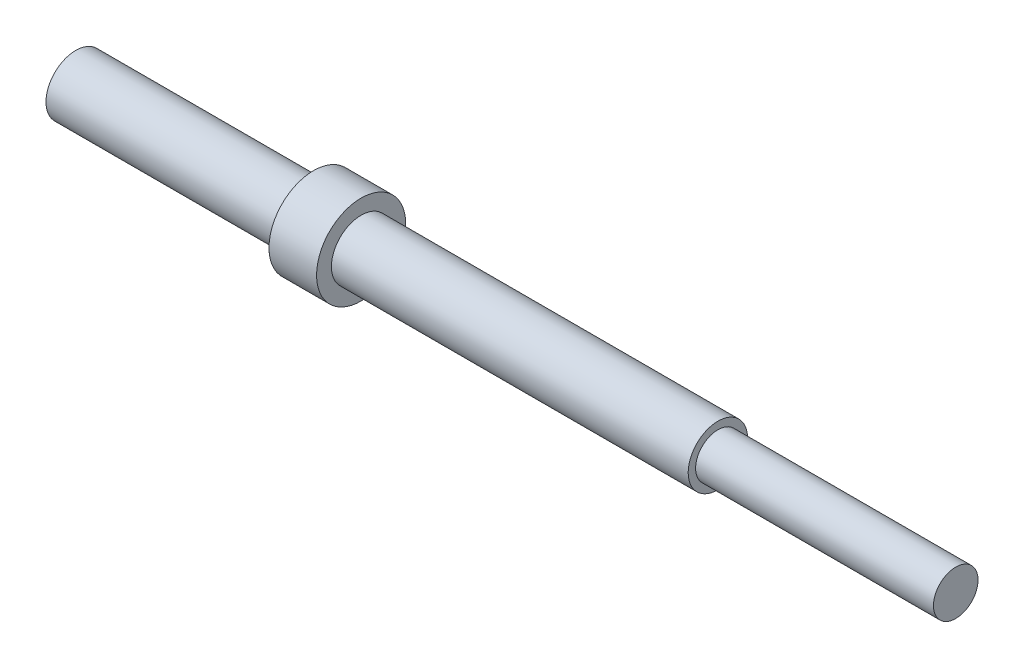
ISO-10303-21;
HEADER;
FILE_DESCRIPTION(('STEP AP214'),'2;1');
FILE_NAME('part.step','',(''),(''),'','','');
FILE_SCHEMA(('AUTOMOTIVE_DESIGN { 1 0 10303 214 1 1 1 1 }'));
ENDSEC;
DATA;
#1=APPLICATION_CONTEXT('core data for automotive mechanical design processes');
#2=APPLICATION_PROTOCOL_DEFINITION('international standard','automotive_design',2000,#1);
#3=PRODUCT_CONTEXT('',#1,'mechanical');
#4=PRODUCT('Part','Part','',(#3));
#5=PRODUCT_RELATED_PRODUCT_CATEGORY('part','',(#4));
#6=PRODUCT_DEFINITION_FORMATION('','',#4);
#7=PRODUCT_DEFINITION_CONTEXT('part definition',#1,'design');
#8=PRODUCT_DEFINITION('design','',#6,#7);
#9=PRODUCT_DEFINITION_SHAPE('','',#8);
#10=(LENGTH_UNIT() NAMED_UNIT(*) SI_UNIT(.MILLI.,.METRE.));
#11=(NAMED_UNIT(*) PLANE_ANGLE_UNIT() SI_UNIT($,.RADIAN.));
#12=(NAMED_UNIT(*) SI_UNIT($,.STERADIAN.) SOLID_ANGLE_UNIT());
#13=UNCERTAINTY_MEASURE_WITH_UNIT(LENGTH_MEASURE(1.E-05),#10,'distance_accuracy_value','');
#14=(GEOMETRIC_REPRESENTATION_CONTEXT(3) GLOBAL_UNCERTAINTY_ASSIGNED_CONTEXT((#13)) GLOBAL_UNIT_ASSIGNED_CONTEXT((#10,
#11,#12)) REPRESENTATION_CONTEXT('',''));
#15=CARTESIAN_POINT('',(0.,0.,0.));
#16=DIRECTION('',(0.,0.,1.));
#17=DIRECTION('',(1.,0.,0.));
#18=AXIS2_PLACEMENT_3D('',#15,#16,#17);
#19=CARTESIAN_POINT('',(93.98,2.38125,0.));
#20=DIRECTION('',(1.,0.,0.));
#21=DIRECTION('',(0.,0.,-1.));
#22=AXIS2_PLACEMENT_3D('',#19,#20,#21);
#23=PLANE('',#22);
#24=CARTESIAN_POINT('',(93.98,0.,0.));
#25=DIRECTION('',(-1.,0.,0.));
#26=DIRECTION('',(0.,0.,1.));
#27=AXIS2_PLACEMENT_3D('',#24,#25,#26);
#28=CIRCLE('',#27,2.38125);
#29=CARTESIAN_POINT('',(93.98,0.,2.38125));
#30=VERTEX_POINT('',#29);
#31=EDGE_CURVE('E10',#30,#30,#28,.T.);
#32=ORIENTED_EDGE('',*,*,#31,.F.);
#33=EDGE_LOOP('',(#32));
#34=FACE_BOUND('',#33,.T.);
#35=ADVANCED_FACE('F31',(#34),#23,.T.);
#36=CARTESIAN_POINT('',(0.,0.,0.));
#37=DIRECTION('',(-1.,0.,0.));
#38=DIRECTION('',(0.,0.,1.));
#39=AXIS2_PLACEMENT_3D('',#36,#37,#38);
#40=CYLINDRICAL_SURFACE('',#39,2.38125);
#41=ORIENTED_EDGE('',*,*,#31,.T.);
#42=EDGE_LOOP('',(#41));
#43=FACE_BOUND('',#42,.T.);
#44=CARTESIAN_POINT('',(68.58,0.,0.));
#45=DIRECTION('',(-1.,0.,0.));
#46=DIRECTION('',(0.,0.,1.));
#47=AXIS2_PLACEMENT_3D('',#44,#45,#46);
#48=CIRCLE('',#47,2.38125);
#49=CARTESIAN_POINT('',(68.58,0.,2.38125));
#50=VERTEX_POINT('',#49);
#51=EDGE_CURVE('E37',#50,#50,#48,.T.);
#52=ORIENTED_EDGE('',*,*,#51,.F.);
#53=EDGE_LOOP('',(#52));
#54=FACE_BOUND('',#53,.T.);
#55=ADVANCED_FACE('F89',(#43,#54),#40,.T.);
#56=CARTESIAN_POINT('',(68.58,3.175,0.));
#57=DIRECTION('',(1.,0.,0.));
#58=DIRECTION('',(0.,0.,-1.));
#59=AXIS2_PLACEMENT_3D('',#56,#57,#58);
#60=PLANE('',#59);
#61=ORIENTED_EDGE('',*,*,#51,.T.);
#62=EDGE_LOOP('',(#61));
#63=FACE_BOUND('',#62,.T.);
#64=CARTESIAN_POINT('',(68.58,0.,0.));
#65=DIRECTION('',(-1.,0.,0.));
#66=DIRECTION('',(0.,0.,1.));
#67=AXIS2_PLACEMENT_3D('',#64,#65,#66);
#68=CIRCLE('',#67,3.175);
#69=CARTESIAN_POINT('',(68.58,0.,3.175));
#70=VERTEX_POINT('',#69);
#71=EDGE_CURVE('E41',#70,#70,#68,.T.);
#72=ORIENTED_EDGE('',*,*,#71,.F.);
#73=EDGE_LOOP('',(#72));
#74=FACE_BOUND('',#73,.T.);
#75=ADVANCED_FACE('F94',(#63,#74),#60,.T.);
#76=CARTESIAN_POINT('',(0.,0.,0.));
#77=DIRECTION('',(-1.,0.,0.));
#78=DIRECTION('',(0.,0.,1.));
#79=AXIS2_PLACEMENT_3D('',#76,#77,#78);
#80=CYLINDRICAL_SURFACE('',#79,3.175);
#81=ORIENTED_EDGE('',*,*,#71,.T.);
#82=EDGE_LOOP('',(#81));
#83=FACE_BOUND('',#82,.T.);
#84=CARTESIAN_POINT('',(30.48,0.,0.));
#85=DIRECTION('',(-1.,0.,0.));
#86=DIRECTION('',(0.,0.,1.));
#87=AXIS2_PLACEMENT_3D('',#84,#85,#86);
#88=CIRCLE('',#87,3.175);
#89=CARTESIAN_POINT('',(30.48,0.,3.175));
#90=VERTEX_POINT('',#89);
#91=EDGE_CURVE('E45',#90,#90,#88,.T.);
#92=ORIENTED_EDGE('',*,*,#91,.F.);
#93=EDGE_LOOP('',(#92));
#94=FACE_BOUND('',#93,.T.);
#95=ADVANCED_FACE('F98',(#83,#94),#80,.T.);
#96=CARTESIAN_POINT('',(30.48,4.7625,0.));
#97=DIRECTION('',(1.,0.,0.));
#98=DIRECTION('',(0.,0.,-1.));
#99=AXIS2_PLACEMENT_3D('',#96,#97,#98);
#100=PLANE('',#99);
#101=ORIENTED_EDGE('',*,*,#91,.T.);
#102=EDGE_LOOP('',(#101));
#103=FACE_BOUND('',#102,.T.);
#104=CARTESIAN_POINT('',(30.48,0.,0.));
#105=DIRECTION('',(-1.,0.,0.));
#106=DIRECTION('',(0.,0.,1.));
#107=AXIS2_PLACEMENT_3D('',#104,#105,#106);
#108=CIRCLE('',#107,4.7625);
#109=CARTESIAN_POINT('',(30.48,0.,4.7625));
#110=VERTEX_POINT('',#109);
#111=EDGE_CURVE('E50',#110,#110,#108,.T.);
#112=ORIENTED_EDGE('',*,*,#111,.F.);
#113=EDGE_LOOP('',(#112));
#114=FACE_BOUND('',#113,.T.);
#115=ADVANCED_FACE('F104',(#103,#114),#100,.T.);
#116=CARTESIAN_POINT('',(0.,0.,0.));
#117=DIRECTION('',(-1.,0.,0.));
#118=DIRECTION('',(0.,0.,1.));
#119=AXIS2_PLACEMENT_3D('',#116,#117,#118);
#120=CYLINDRICAL_SURFACE('',#119,4.7625);
#121=ORIENTED_EDGE('',*,*,#111,.T.);
#122=EDGE_LOOP('',(#121));
#123=FACE_BOUND('',#122,.T.);
#124=CARTESIAN_POINT('',(25.4,0.,0.));
#125=DIRECTION('',(-1.,0.,0.));
#126=DIRECTION('',(0.,0.,1.));
#127=AXIS2_PLACEMENT_3D('',#124,#125,#126);
#128=CIRCLE('',#127,4.7625);
#129=CARTESIAN_POINT('',(25.4,0.,4.7625));
#130=VERTEX_POINT('',#129);
#131=EDGE_CURVE('E53',#130,#130,#128,.T.);
#132=ORIENTED_EDGE('',*,*,#131,.F.);
#133=EDGE_LOOP('',(#132));
#134=FACE_BOUND('',#133,.T.);
#135=ADVANCED_FACE('F108',(#123,#134),#120,.T.);
#136=CARTESIAN_POINT('',(25.4,3.175,0.));
#137=DIRECTION('',(-1.,0.,0.));
#138=DIRECTION('',(0.,0.,1.));
#139=AXIS2_PLACEMENT_3D('',#136,#137,#138);
#140=PLANE('',#139);
#141=ORIENTED_EDGE('',*,*,#131,.T.);
#142=EDGE_LOOP('',(#141));
#143=FACE_BOUND('',#142,.T.);
#144=CARTESIAN_POINT('',(25.4,0.,0.));
#145=DIRECTION('',(-1.,0.,0.));
#146=DIRECTION('',(0.,0.,1.));
#147=AXIS2_PLACEMENT_3D('',#144,#145,#146);
#148=CIRCLE('',#147,3.175);
#149=CARTESIAN_POINT('',(25.4,0.,3.175));
#150=VERTEX_POINT('',#149);
#151=EDGE_CURVE('E56',#150,#150,#148,.T.);
#152=ORIENTED_EDGE('',*,*,#151,.F.);
#153=EDGE_LOOP('',(#152));
#154=FACE_BOUND('',#153,.T.);
#155=ADVANCED_FACE('F85',(#143,#154),#140,.T.);
#156=CARTESIAN_POINT('',(0.,0.,0.));
#157=DIRECTION('',(-1.,0.,0.));
#158=DIRECTION('',(0.,0.,1.));
#159=AXIS2_PLACEMENT_3D('',#156,#157,#158);
#160=CYLINDRICAL_SURFACE('',#159,3.175);
#161=ORIENTED_EDGE('',*,*,#151,.T.);
#162=EDGE_LOOP('',(#161));
#163=FACE_BOUND('',#162,.T.);
#164=CARTESIAN_POINT('',(0.,0.,0.));
#165=DIRECTION('',(-1.,0.,0.));
#166=DIRECTION('',(0.,0.,1.));
#167=AXIS2_PLACEMENT_3D('',#164,#165,#166);
#168=CIRCLE('',#167,3.175);
#169=CARTESIAN_POINT('',(0.,0.,3.175));
#170=VERTEX_POINT('',#169);
#171=EDGE_CURVE('E59',#170,#170,#168,.T.);
#172=ORIENTED_EDGE('',*,*,#171,.F.);
#173=EDGE_LOOP('',(#172));
#174=FACE_BOUND('',#173,.T.);
#175=ADVANCED_FACE('F79',(#163,#174),#160,.T.);
#176=CARTESIAN_POINT('',(0.,1.90500000000025,0.));
#177=DIRECTION('',(-1.,0.,0.));
#178=DIRECTION('',(0.,0.,1.));
#179=AXIS2_PLACEMENT_3D('',#176,#177,#178);
#180=PLANE('',#179);
#181=ORIENTED_EDGE('',*,*,#171,.T.);
#182=EDGE_LOOP('',(#181));
#183=FACE_BOUND('',#182,.T.);
#184=CARTESIAN_POINT('',(0.,0.,0.));
#185=DIRECTION('',(-1.,0.,0.));
#186=DIRECTION('',(0.,0.,1.));
#187=AXIS2_PLACEMENT_3D('',#184,#185,#186);
#188=CIRCLE('',#187,1.90500000000025);
#189=CARTESIAN_POINT('',(0.,0.,1.90500000000025));
#190=VERTEX_POINT('',#189);
#191=EDGE_CURVE('E62',#190,#190,#188,.T.);
#192=ORIENTED_EDGE('',*,*,#191,.F.);
#193=EDGE_LOOP('',(#192));
#194=FACE_BOUND('',#193,.T.);
#195=ADVANCED_FACE('F74',(#183,#194),#180,.T.);
#196=CARTESIAN_POINT('',(0.,0.,0.));
#197=DIRECTION('',(-1.,0.,0.));
#198=DIRECTION('',(0.,0.,1.));
#199=AXIS2_PLACEMENT_3D('',#196,#197,#198);
#200=CYLINDRICAL_SURFACE('',#199,1.90500000000013);
#201=CARTESIAN_POINT('',(38.1,0.,0.));
#202=DIRECTION('',(-1.,0.,0.));
#203=DIRECTION('',(0.,0.,1.));
#204=AXIS2_PLACEMENT_3D('',#201,#202,#203);
#205=CIRCLE('',#204,1.905);
#206=CARTESIAN_POINT('',(38.1,0.,1.905));
#207=VERTEX_POINT('',#206);
#208=EDGE_CURVE('E65',#207,#207,#205,.T.);
#209=ORIENTED_EDGE('',*,*,#208,.F.);
#210=EDGE_LOOP('',(#209));
#211=FACE_BOUND('',#210,.T.);
#212=ORIENTED_EDGE('',*,*,#191,.T.);
#213=EDGE_LOOP('',(#212));
#214=FACE_BOUND('',#213,.T.);
#215=ADVANCED_FACE('F71',(#211,#214),#200,.F.);
#216=CARTESIAN_POINT('',(38.1,1.905,0.));
#217=DIRECTION('',(1.,0.,0.));
#218=DIRECTION('',(0.,0.,-1.));
#219=AXIS2_PLACEMENT_3D('',#216,#217,#218);
#220=PLANE('',#219);
#221=ORIENTED_EDGE('',*,*,#208,.T.);
#222=EDGE_LOOP('',(#221));
#223=FACE_BOUND('',#222,.T.);
#224=ADVANCED_FACE('F69',(#223),#220,.F.);
#225=CLOSED_SHELL('',(#35,#55,#75,#95,#115,#135,#155,#175,#195,#215,#224));
#226=MANIFOLD_SOLID_BREP('B2',#225);
#227=ADVANCED_BREP_SHAPE_REPRESENTATION('',(#18,#226),#14);
#228=SHAPE_DEFINITION_REPRESENTATION(#9,#227);
ENDSEC;
END-ISO-10303-21;
